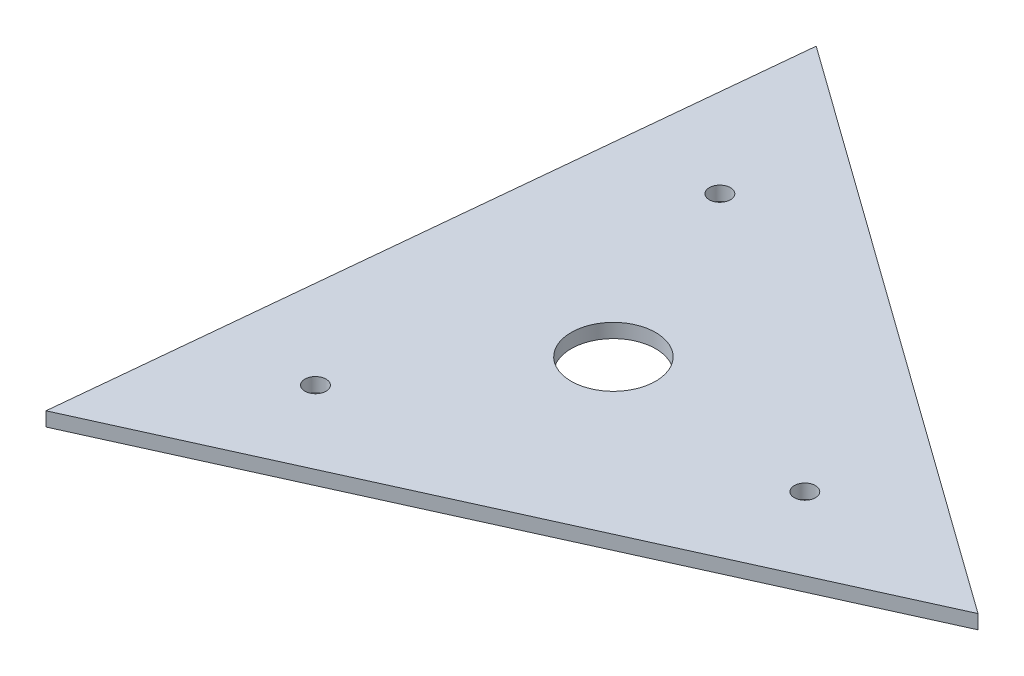
ISO-10303-21;
HEADER;
FILE_DESCRIPTION(('STEP AP214'),'2;1');
FILE_NAME('part.step','',(''),(''),'','','');
FILE_SCHEMA(('AUTOMOTIVE_DESIGN { 1 0 10303 214 1 1 1 1 }'));
ENDSEC;
DATA;
#1=APPLICATION_CONTEXT('core data for automotive mechanical design processes');
#2=APPLICATION_PROTOCOL_DEFINITION('international standard','automotive_design',2000,#1);
#3=PRODUCT_CONTEXT('',#1,'mechanical');
#4=PRODUCT('Part','Part','',(#3));
#5=PRODUCT_RELATED_PRODUCT_CATEGORY('part','',(#4));
#6=PRODUCT_DEFINITION_FORMATION('','',#4);
#7=PRODUCT_DEFINITION_CONTEXT('part definition',#1,'design');
#8=PRODUCT_DEFINITION('design','',#6,#7);
#9=PRODUCT_DEFINITION_SHAPE('','',#8);
#10=(LENGTH_UNIT() NAMED_UNIT(*) SI_UNIT(.MILLI.,.METRE.));
#11=(NAMED_UNIT(*) PLANE_ANGLE_UNIT() SI_UNIT($,.RADIAN.));
#12=(NAMED_UNIT(*) SI_UNIT($,.STERADIAN.) SOLID_ANGLE_UNIT());
#13=UNCERTAINTY_MEASURE_WITH_UNIT(LENGTH_MEASURE(1.E-05),#10,'distance_accuracy_value','');
#14=(GEOMETRIC_REPRESENTATION_CONTEXT(3) GLOBAL_UNCERTAINTY_ASSIGNED_CONTEXT((#13)) GLOBAL_UNIT_ASSIGNED_CONTEXT((#10,
#11,#12)) REPRESENTATION_CONTEXT('',''));
#15=CARTESIAN_POINT('',(0.,0.,0.));
#16=DIRECTION('',(0.,0.,1.));
#17=DIRECTION('',(1.,0.,0.));
#18=AXIS2_PLACEMENT_3D('',#15,#16,#17);
#19=CARTESIAN_POINT('',(0.,10.,0.));
#20=DIRECTION('',(0.,1.,0.));
#21=DIRECTION('',(0.,0.,1.));
#22=AXIS2_PLACEMENT_3D('',#19,#20,#21);
#23=PLANE('',#22);
#24=CARTESIAN_POINT('',(-88.349364905389,10.,123.177313259562));
#25=DIRECTION('',(0.,1.,0.));
#26=DIRECTION('',(0.,0.,1.));
#27=AXIS2_PLACEMENT_3D('',#24,#25,#26);
#28=CIRCLE('',#27,7.50000000000001);
#29=CARTESIAN_POINT('',(-88.349364905389,10.,130.677313259562));
#30=VERTEX_POINT('',#29);
#31=EDGE_CURVE('E118',#30,#30,#28,.T.);
#32=ORIENTED_EDGE('',*,*,#31,.F.);
#33=EDGE_LOOP('',(#32));
#34=FACE_BOUND('',#33,.T.);
#35=CARTESIAN_POINT('',(-62.4999999999999,10.,-138.101451046069));
#36=DIRECTION('',(0.,1.,0.));
#37=DIRECTION('',(0.,0.,1.));
#38=AXIS2_PLACEMENT_3D('',#35,#36,#37);
#39=CIRCLE('',#38,7.50000000000001);
#40=CARTESIAN_POINT('',(-62.4999999999999,10.,-130.601451046069));
#41=VERTEX_POINT('',#40);
#42=EDGE_CURVE('E84',#41,#41,#39,.T.);
#43=ORIENTED_EDGE('',*,*,#42,.F.);
#44=EDGE_LOOP('',(#43));
#45=FACE_BOUND('',#44,.T.);
#46=DIRECTION('',(0.91104465561765,0.,-0.412307695138615));
#47=VECTOR('',#46,1.);
#48=CARTESIAN_POINT('',(-168.249674210104,10.,234.574893075809));
#49=LINE('',#48,#47);
#50=CARTESIAN_POINT('',(-168.249674210104,10.,234.574893075809));
#51=VERTEX_POINT('',#50);
#52=CARTESIAN_POINT('',(287.272653598721,10.,28.4210455065012));
#53=VERTEX_POINT('',#52);
#54=EDGE_CURVE('E74',#51,#53,#49,.T.);
#55=ORIENTED_EDGE('',*,*,#54,.T.);
#56=DIRECTION('',(-0.812591265974676,0.,-0.582833968177623));
#57=VECTOR('',#56,1.);
#58=CARTESIAN_POINT('',(287.272653598721,10.,28.4210455065012));
#59=LINE('',#58,#57);
#60=CARTESIAN_POINT('',(-119.022979388617,10.,-262.99593858231));
#61=VERTEX_POINT('',#60);
#62=EDGE_CURVE('E70',#53,#61,#59,.T.);
#63=ORIENTED_EDGE('',*,*,#62,.T.);
#64=DIRECTION('',(-0.0984533896429742,0.,0.995141663316238));
#65=VECTOR('',#64,1.);
#66=CARTESIAN_POINT('',(-119.022979388617,10.,-262.99593858231));
#67=LINE('',#66,#65);
#68=EDGE_CURVE('E50',#61,#51,#67,.T.);
#69=ORIENTED_EDGE('',*,*,#68,.T.);
#70=EDGE_LOOP('',(#55,#63,#69));
#71=FACE_BOUND('',#70,.T.);
#72=CARTESIAN_POINT('',(150.849364905389,10.,14.9241377865072));
#73=DIRECTION('',(0.,1.,0.));
#74=DIRECTION('',(0.,0.,1.));
#75=AXIS2_PLACEMENT_3D('',#72,#73,#74);
#76=CIRCLE('',#75,7.50000000000004);
#77=CARTESIAN_POINT('',(150.849364905389,10.,22.4241377865073));
#78=VERTEX_POINT('',#77);
#79=EDGE_CURVE('E122',#78,#78,#76,.T.);
#80=ORIENTED_EDGE('',*,*,#79,.F.);
#81=EDGE_LOOP('',(#80));
#82=FACE_BOUND('',#81,.T.);
#83=CARTESIAN_POINT('',(0.,10.,0.));
#84=DIRECTION('',(0.,1.,0.));
#85=DIRECTION('',(0.,0.,1.));
#86=AXIS2_PLACEMENT_3D('',#83,#84,#85);
#87=CIRCLE('',#86,30.);
#88=CARTESIAN_POINT('',(0.,10.,30.));
#89=VERTEX_POINT('',#88);
#90=EDGE_CURVE('E113',#89,#89,#87,.T.);
#91=ORIENTED_EDGE('',*,*,#90,.F.);
#92=EDGE_LOOP('',(#91));
#93=FACE_BOUND('',#92,.T.);
#94=ADVANCED_FACE('F33',(#34,#45,#71,#82,#93),#23,.T.);
#95=CARTESIAN_POINT('',(0.,0.,0.));
#96=DIRECTION('',(0.,1.,0.));
#97=DIRECTION('',(0.,0.,1.));
#98=AXIS2_PLACEMENT_3D('',#95,#96,#97);
#99=PLANE('',#98);
#100=DIRECTION('',(0.91104465561765,0.,-0.412307695138615));
#101=VECTOR('',#100,1.);
#102=CARTESIAN_POINT('',(-168.249674210104,0.,234.574893075809));
#103=LINE('',#102,#101);
#104=CARTESIAN_POINT('',(-168.249674210104,0.,234.574893075809));
#105=VERTEX_POINT('',#104);
#106=CARTESIAN_POINT('',(287.272653598721,0.,28.4210455065012));
#107=VERTEX_POINT('',#106);
#108=EDGE_CURVE('E81',#105,#107,#103,.T.);
#109=ORIENTED_EDGE('',*,*,#108,.F.);
#110=DIRECTION('',(-0.0984533896429742,0.,0.995141663316238));
#111=VECTOR('',#110,1.);
#112=CARTESIAN_POINT('',(-119.022979388617,0.,-262.99593858231));
#113=LINE('',#112,#111);
#114=CARTESIAN_POINT('',(-119.022979388617,0.,-262.99593858231));
#115=VERTEX_POINT('',#114);
#116=EDGE_CURVE('E67',#115,#105,#113,.T.);
#117=ORIENTED_EDGE('',*,*,#116,.F.);
#118=DIRECTION('',(-0.812591265974676,0.,-0.582833968177623));
#119=VECTOR('',#118,1.);
#120=CARTESIAN_POINT('',(287.272653598721,0.,28.4210455065012));
#121=LINE('',#120,#119);
#122=EDGE_CURVE('E62',#107,#115,#121,.T.);
#123=ORIENTED_EDGE('',*,*,#122,.F.);
#124=EDGE_LOOP('',(#109,#117,#123));
#125=FACE_BOUND('',#124,.T.);
#126=CARTESIAN_POINT('',(-62.4999999999999,0.,-138.101451046069));
#127=DIRECTION('',(0.,1.,0.));
#128=DIRECTION('',(0.,0.,1.));
#129=AXIS2_PLACEMENT_3D('',#126,#127,#128);
#130=CIRCLE('',#129,7.50000000000001);
#131=CARTESIAN_POINT('',(-62.4999999999999,0.,-130.601451046069));
#132=VERTEX_POINT('',#131);
#133=EDGE_CURVE('E88',#132,#132,#130,.T.);
#134=ORIENTED_EDGE('',*,*,#133,.T.);
#135=EDGE_LOOP('',(#134));
#136=FACE_BOUND('',#135,.T.);
#137=CARTESIAN_POINT('',(150.849364905389,0.,14.9241377865072));
#138=DIRECTION('',(0.,1.,0.));
#139=DIRECTION('',(0.,0.,1.));
#140=AXIS2_PLACEMENT_3D('',#137,#138,#139);
#141=CIRCLE('',#140,7.50000000000004);
#142=CARTESIAN_POINT('',(150.849364905389,0.,22.4241377865073));
#143=VERTEX_POINT('',#142);
#144=EDGE_CURVE('E104',#143,#143,#141,.T.);
#145=ORIENTED_EDGE('',*,*,#144,.T.);
#146=EDGE_LOOP('',(#145));
#147=FACE_BOUND('',#146,.T.);
#148=CARTESIAN_POINT('',(-88.349364905389,0.,123.177313259562));
#149=DIRECTION('',(0.,1.,0.));
#150=DIRECTION('',(0.,0.,1.));
#151=AXIS2_PLACEMENT_3D('',#148,#149,#150);
#152=CIRCLE('',#151,7.50000000000001);
#153=CARTESIAN_POINT('',(-88.349364905389,0.,130.677313259562));
#154=VERTEX_POINT('',#153);
#155=EDGE_CURVE('E108',#154,#154,#152,.T.);
#156=ORIENTED_EDGE('',*,*,#155,.T.);
#157=EDGE_LOOP('',(#156));
#158=FACE_BOUND('',#157,.T.);
#159=CARTESIAN_POINT('',(0.,0.,0.));
#160=DIRECTION('',(0.,1.,0.));
#161=DIRECTION('',(0.,0.,1.));
#162=AXIS2_PLACEMENT_3D('',#159,#160,#161);
#163=CIRCLE('',#162,30.);
#164=CARTESIAN_POINT('',(0.,0.,30.));
#165=VERTEX_POINT('',#164);
#166=EDGE_CURVE('E111',#165,#165,#163,.T.);
#167=ORIENTED_EDGE('',*,*,#166,.T.);
#168=EDGE_LOOP('',(#167));
#169=FACE_BOUND('',#168,.T.);
#170=ADVANCED_FACE('F94',(#125,#136,#147,#158,#169),#99,.F.);
#171=CARTESIAN_POINT('',(-168.249674210104,10.,234.574893075809));
#172=DIRECTION('',(-0.412307695138615,0.,-0.91104465561765));
#173=DIRECTION('',(-0.91104465561765,0.,0.412307695138615));
#174=AXIS2_PLACEMENT_3D('',#171,#172,#173);
#175=PLANE('',#174);
#176=ORIENTED_EDGE('',*,*,#108,.T.);
#177=DIRECTION('',(0.,-1.,0.));
#178=VECTOR('',#177,1.);
#179=CARTESIAN_POINT('',(287.272653598721,10.,28.4210455065012));
#180=LINE('',#179,#178);
#181=EDGE_CURVE('E11',#53,#107,#180,.T.);
#182=ORIENTED_EDGE('',*,*,#181,.F.);
#183=ORIENTED_EDGE('',*,*,#54,.F.);
#184=DIRECTION('',(0.,-1.,0.));
#185=VECTOR('',#184,1.);
#186=CARTESIAN_POINT('',(-168.249674210104,10.,234.574893075809));
#187=LINE('',#186,#185);
#188=EDGE_CURVE('E82',#51,#105,#187,.T.);
#189=ORIENTED_EDGE('',*,*,#188,.T.);
#190=EDGE_LOOP('',(#176,#182,#183,#189));
#191=FACE_BOUND('',#190,.T.);
#192=ADVANCED_FACE('F35',(#191),#175,.F.);
#193=CARTESIAN_POINT('',(287.272653598721,10.,28.4210455065012));
#194=DIRECTION('',(-0.582833968177623,0.,0.812591265974675));
#195=DIRECTION('',(0.812591265974675,0.,0.582833968177623));
#196=AXIS2_PLACEMENT_3D('',#193,#194,#195);
#197=PLANE('',#196);
#198=ORIENTED_EDGE('',*,*,#122,.T.);
#199=DIRECTION('',(0.,-1.,0.));
#200=VECTOR('',#199,1.);
#201=CARTESIAN_POINT('',(-119.022979388617,10.,-262.99593858231));
#202=LINE('',#201,#200);
#203=EDGE_CURVE('E42',#61,#115,#202,.T.);
#204=ORIENTED_EDGE('',*,*,#203,.F.);
#205=ORIENTED_EDGE('',*,*,#62,.F.);
#206=ORIENTED_EDGE('',*,*,#181,.T.);
#207=EDGE_LOOP('',(#198,#204,#205,#206));
#208=FACE_BOUND('',#207,.T.);
#209=ADVANCED_FACE('F71',(#208),#197,.F.);
#210=CARTESIAN_POINT('',(-119.022979388617,10.,-262.99593858231));
#211=DIRECTION('',(0.995141663316238,0.,0.0984533896429742));
#212=DIRECTION('',(0.0984533896429742,0.,-0.995141663316238));
#213=AXIS2_PLACEMENT_3D('',#210,#211,#212);
#214=PLANE('',#213);
#215=ORIENTED_EDGE('',*,*,#116,.T.);
#216=ORIENTED_EDGE('',*,*,#188,.F.);
#217=ORIENTED_EDGE('',*,*,#68,.F.);
#218=ORIENTED_EDGE('',*,*,#203,.T.);
#219=EDGE_LOOP('',(#215,#216,#217,#218));
#220=FACE_BOUND('',#219,.T.);
#221=ADVANCED_FACE('F93',(#220),#214,.F.);
#222=CARTESIAN_POINT('',(-62.4999999999999,10.,-138.101451046069));
#223=DIRECTION('',(0.,-1.,0.));
#224=DIRECTION('',(0.,0.,-1.));
#225=AXIS2_PLACEMENT_3D('',#222,#223,#224);
#226=CYLINDRICAL_SURFACE('',#225,7.50000000000001);
#227=ORIENTED_EDGE('',*,*,#42,.T.);
#228=EDGE_LOOP('',(#227));
#229=FACE_BOUND('',#228,.T.);
#230=ORIENTED_EDGE('',*,*,#133,.F.);
#231=EDGE_LOOP('',(#230));
#232=FACE_BOUND('',#231,.T.);
#233=ADVANCED_FACE('F148',(#229,#232),#226,.F.);
#234=CARTESIAN_POINT('',(150.849364905389,10.,14.9241377865072));
#235=DIRECTION('',(0.,-1.,0.));
#236=DIRECTION('',(0.,0.,-1.));
#237=AXIS2_PLACEMENT_3D('',#234,#235,#236);
#238=CYLINDRICAL_SURFACE('',#237,7.50000000000004);
#239=ORIENTED_EDGE('',*,*,#79,.T.);
#240=EDGE_LOOP('',(#239));
#241=FACE_BOUND('',#240,.T.);
#242=ORIENTED_EDGE('',*,*,#144,.F.);
#243=EDGE_LOOP('',(#242));
#244=FACE_BOUND('',#243,.T.);
#245=ADVANCED_FACE('F128',(#241,#244),#238,.F.);
#246=CARTESIAN_POINT('',(-88.349364905389,10.,123.177313259562));
#247=DIRECTION('',(0.,-1.,0.));
#248=DIRECTION('',(0.,0.,-1.));
#249=AXIS2_PLACEMENT_3D('',#246,#247,#248);
#250=CYLINDRICAL_SURFACE('',#249,7.50000000000001);
#251=ORIENTED_EDGE('',*,*,#31,.T.);
#252=EDGE_LOOP('',(#251));
#253=FACE_BOUND('',#252,.T.);
#254=ORIENTED_EDGE('',*,*,#155,.F.);
#255=EDGE_LOOP('',(#254));
#256=FACE_BOUND('',#255,.T.);
#257=ADVANCED_FACE('F138',(#253,#256),#250,.F.);
#258=CARTESIAN_POINT('',(0.,10.,0.));
#259=DIRECTION('',(0.,-1.,0.));
#260=DIRECTION('',(0.,0.,-1.));
#261=AXIS2_PLACEMENT_3D('',#258,#259,#260);
#262=CYLINDRICAL_SURFACE('',#261,30.);
#263=ORIENTED_EDGE('',*,*,#90,.T.);
#264=EDGE_LOOP('',(#263));
#265=FACE_BOUND('',#264,.T.);
#266=ORIENTED_EDGE('',*,*,#166,.F.);
#267=EDGE_LOOP('',(#266));
#268=FACE_BOUND('',#267,.T.);
#269=ADVANCED_FACE('F136',(#265,#268),#262,.F.);
#270=CLOSED_SHELL('',(#94,#170,#192,#209,#221,#233,#245,#257,#269));
#271=MANIFOLD_SOLID_BREP('B2',#270);
#272=ADVANCED_BREP_SHAPE_REPRESENTATION('',(#18,#271),#14);
#273=SHAPE_DEFINITION_REPRESENTATION(#9,#272);
ENDSEC;
END-ISO-10303-21;
